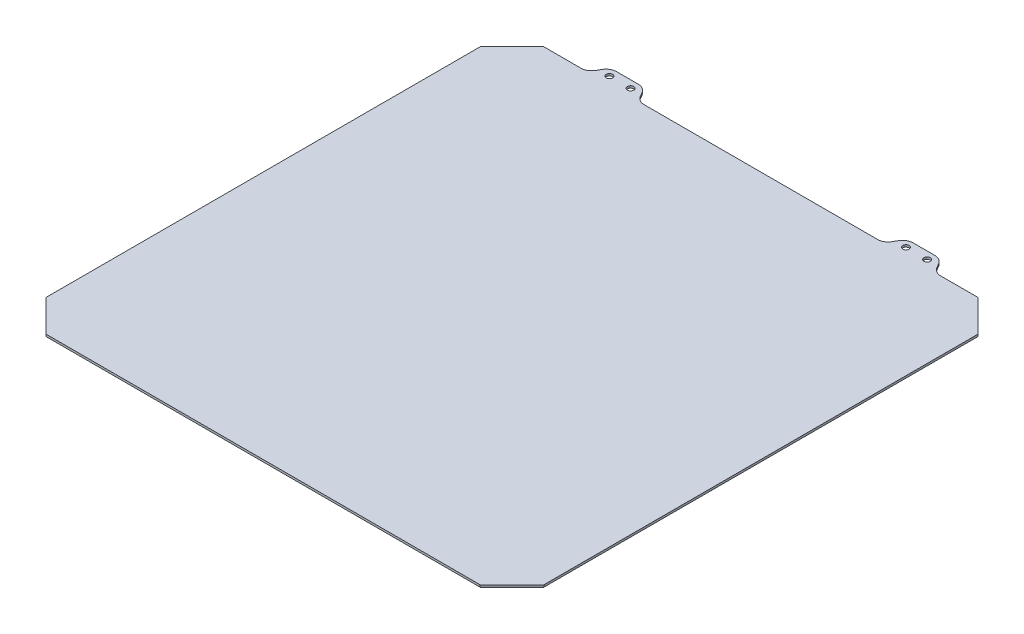
ISO-10303-21;
HEADER;
FILE_DESCRIPTION(('STEP AP214'),'2;1');
FILE_NAME('part.step','',(''),(''),'','','');
FILE_SCHEMA(('AUTOMOTIVE_DESIGN { 1 0 10303 214 1 1 1 1 }'));
ENDSEC;
DATA;
#1=APPLICATION_CONTEXT('core data for automotive mechanical design processes');
#2=APPLICATION_PROTOCOL_DEFINITION('international standard','automotive_design',2000,#1);
#3=PRODUCT_CONTEXT('',#1,'mechanical');
#4=PRODUCT('Part','Part','',(#3));
#5=PRODUCT_RELATED_PRODUCT_CATEGORY('part','',(#4));
#6=PRODUCT_DEFINITION_FORMATION('','',#4);
#7=PRODUCT_DEFINITION_CONTEXT('part definition',#1,'design');
#8=PRODUCT_DEFINITION('design','',#6,#7);
#9=PRODUCT_DEFINITION_SHAPE('','',#8);
#10=(LENGTH_UNIT() NAMED_UNIT(*) SI_UNIT(.MILLI.,.METRE.));
#11=(NAMED_UNIT(*) PLANE_ANGLE_UNIT() SI_UNIT($,.RADIAN.));
#12=(NAMED_UNIT(*) SI_UNIT($,.STERADIAN.) SOLID_ANGLE_UNIT());
#13=UNCERTAINTY_MEASURE_WITH_UNIT(LENGTH_MEASURE(1.E-05),#10,'distance_accuracy_value','');
#14=(GEOMETRIC_REPRESENTATION_CONTEXT(3) GLOBAL_UNCERTAINTY_ASSIGNED_CONTEXT((#13)) GLOBAL_UNIT_ASSIGNED_CONTEXT((#10,
#11,#12)) REPRESENTATION_CONTEXT('',''));
#15=CARTESIAN_POINT('',(0.,0.,0.));
#16=DIRECTION('',(0.,0.,1.));
#17=DIRECTION('',(1.,0.,0.));
#18=AXIS2_PLACEMENT_3D('',#15,#16,#17);
#19=CARTESIAN_POINT('',(117.5,1.,-117.5));
#20=DIRECTION('',(0.,0.,1.));
#21=DIRECTION('',(1.,0.,0.));
#22=AXIS2_PLACEMENT_3D('',#19,#20,#21);
#23=PLANE('',#22);
#24=DIRECTION('',(-1.,0.,0.));
#25=VECTOR('',#24,1.);
#26=CARTESIAN_POINT('',(117.5,0.,-117.5));
#27=LINE('',#26,#25);
#28=CARTESIAN_POINT('',(55.0717967697245,0.,-117.5));
#29=VERTEX_POINT('',#28);
#30=CARTESIAN_POINT('',(-55.0717967697244,0.,-117.5));
#31=VERTEX_POINT('',#30);
#32=EDGE_CURVE('E326',#29,#31,#27,.T.);
#33=ORIENTED_EDGE('',*,*,#32,.T.);
#34=DIRECTION('',(0.,-1.,0.));
#35=VECTOR('',#34,1.);
#36=CARTESIAN_POINT('',(-55.0717967697245,1.,-117.5));
#37=LINE('',#36,#35);
#38=CARTESIAN_POINT('',(-55.0717967697244,1.,-117.5));
#39=VERTEX_POINT('',#38);
#40=EDGE_CURVE('E363',#31,#39,#37,.F.);
#41=ORIENTED_EDGE('',*,*,#40,.T.);
#42=DIRECTION('',(-1.,0.,0.));
#43=VECTOR('',#42,1.);
#44=CARTESIAN_POINT('',(117.5,1.,-117.5));
#45=LINE('',#44,#43);
#46=CARTESIAN_POINT('',(55.0717967697245,1.,-117.5));
#47=VERTEX_POINT('',#46);
#48=EDGE_CURVE('E311',#47,#39,#45,.T.);
#49=ORIENTED_EDGE('',*,*,#48,.F.);
#50=DIRECTION('',(0.,-1.,0.));
#51=VECTOR('',#50,1.);
#52=CARTESIAN_POINT('',(55.0717967697245,0.,-117.5));
#53=LINE('',#52,#51);
#54=EDGE_CURVE('E359',#47,#29,#53,.T.);
#55=ORIENTED_EDGE('',*,*,#54,.T.);
#56=EDGE_LOOP('',(#33,#41,#49,#55));
#57=FACE_BOUND('',#56,.T.);
#58=ADVANCED_FACE('F43',(#57),#23,.F.);
#59=CARTESIAN_POINT('',(102.5,1.,-117.5));
#60=VERTEX_POINT('',#59);
#61=CARTESIAN_POINT('',(84.9282032302756,1.,-117.5));
#62=VERTEX_POINT('',#61);
#63=EDGE_CURVE('E308',#60,#62,#45,.T.);
#64=ORIENTED_EDGE('',*,*,#63,.F.);
#65=DIRECTION('',(0.,-1.,0.));
#66=VECTOR('',#65,1.);
#67=CARTESIAN_POINT('',(102.5,1.,-117.5));
#68=LINE('',#67,#66);
#69=CARTESIAN_POINT('',(102.5,0.,-117.5));
#70=VERTEX_POINT('',#69);
#71=EDGE_CURVE('E419',#60,#70,#68,.T.);
#72=ORIENTED_EDGE('',*,*,#71,.T.);
#73=CARTESIAN_POINT('',(84.9282032302756,0.,-117.5));
#74=VERTEX_POINT('',#73);
#75=EDGE_CURVE('E300',#70,#74,#27,.T.);
#76=ORIENTED_EDGE('',*,*,#75,.T.);
#77=DIRECTION('',(0.,-1.,0.));
#78=VECTOR('',#77,1.);
#79=CARTESIAN_POINT('',(84.9282032302755,1.,-117.5));
#80=LINE('',#79,#78);
#81=EDGE_CURVE('E387',#74,#62,#80,.F.);
#82=ORIENTED_EDGE('',*,*,#81,.T.);
#83=EDGE_LOOP('',(#64,#72,#76,#82));
#84=FACE_BOUND('',#83,.T.);
#85=ADVANCED_FACE('F491',(#84),#23,.F.);
#86=CARTESIAN_POINT('',(-117.5,1.,-117.5));
#87=DIRECTION('',(1.,0.,0.));
#88=DIRECTION('',(0.,0.,-1.));
#89=AXIS2_PLACEMENT_3D('',#86,#87,#88);
#90=PLANE('',#89);
#91=DIRECTION('',(0.,0.,1.));
#92=VECTOR('',#91,1.);
#93=CARTESIAN_POINT('',(-117.5,0.,-117.5));
#94=LINE('',#93,#92);
#95=CARTESIAN_POINT('',(-117.5,0.,-102.5));
#96=VERTEX_POINT('',#95);
#97=CARTESIAN_POINT('',(-117.5,0.,102.5));
#98=VERTEX_POINT('',#97);
#99=EDGE_CURVE('E312',#96,#98,#94,.T.);
#100=ORIENTED_EDGE('',*,*,#99,.T.);
#101=DIRECTION('',(0.,1.,0.));
#102=VECTOR('',#101,1.);
#103=CARTESIAN_POINT('',(-117.5,1.,102.5));
#104=LINE('',#103,#102);
#105=CARTESIAN_POINT('',(-117.5,1.,102.5));
#106=VERTEX_POINT('',#105);
#107=EDGE_CURVE('E53',#98,#106,#104,.T.);
#108=ORIENTED_EDGE('',*,*,#107,.T.);
#109=DIRECTION('',(0.,0.,1.));
#110=VECTOR('',#109,1.);
#111=CARTESIAN_POINT('',(-117.5,1.,-117.5));
#112=LINE('',#111,#110);
#113=CARTESIAN_POINT('',(-117.5,1.,-102.5));
#114=VERTEX_POINT('',#113);
#115=EDGE_CURVE('E296',#114,#106,#112,.T.);
#116=ORIENTED_EDGE('',*,*,#115,.F.);
#117=DIRECTION('',(0.,-1.,0.));
#118=VECTOR('',#117,1.);
#119=CARTESIAN_POINT('',(-117.5,1.,-102.5));
#120=LINE('',#119,#118);
#121=EDGE_CURVE('E457',#114,#96,#120,.T.);
#122=ORIENTED_EDGE('',*,*,#121,.T.);
#123=EDGE_LOOP('',(#100,#108,#116,#122));
#124=FACE_BOUND('',#123,.T.);
#125=ADVANCED_FACE('F464',(#124),#90,.F.);
#126=CARTESIAN_POINT('',(117.5,1.,117.5));
#127=DIRECTION('',(0.,0.,-1.));
#128=DIRECTION('',(-1.,0.,0.));
#129=AXIS2_PLACEMENT_3D('',#126,#127,#128);
#130=PLANE('',#129);
#131=DIRECTION('',(1.,0.,0.));
#132=VECTOR('',#131,1.);
#133=CARTESIAN_POINT('',(117.5,0.,117.5));
#134=LINE('',#133,#132);
#135=CARTESIAN_POINT('',(-102.5,0.,117.5));
#136=VERTEX_POINT('',#135);
#137=CARTESIAN_POINT('',(102.5,0.,117.5));
#138=VERTEX_POINT('',#137);
#139=EDGE_CURVE('E316',#136,#138,#134,.T.);
#140=ORIENTED_EDGE('',*,*,#139,.T.);
#141=DIRECTION('',(0.,1.,0.));
#142=VECTOR('',#141,1.);
#143=CARTESIAN_POINT('',(102.5,1.,117.5));
#144=LINE('',#143,#142);
#145=CARTESIAN_POINT('',(102.5,1.,117.5));
#146=VERTEX_POINT('',#145);
#147=EDGE_CURVE('E63',#138,#146,#144,.T.);
#148=ORIENTED_EDGE('',*,*,#147,.T.);
#149=DIRECTION('',(1.,0.,0.));
#150=VECTOR('',#149,1.);
#151=CARTESIAN_POINT('',(117.5,1.,117.5));
#152=LINE('',#151,#150);
#153=CARTESIAN_POINT('',(-102.5,1.,117.5));
#154=VERTEX_POINT('',#153);
#155=EDGE_CURVE('E299',#154,#146,#152,.T.);
#156=ORIENTED_EDGE('',*,*,#155,.F.);
#157=DIRECTION('',(0.,-1.,0.));
#158=VECTOR('',#157,1.);
#159=CARTESIAN_POINT('',(-102.5,1.,117.5));
#160=LINE('',#159,#158);
#161=EDGE_CURVE('E452',#154,#136,#160,.T.);
#162=ORIENTED_EDGE('',*,*,#161,.T.);
#163=EDGE_LOOP('',(#140,#148,#156,#162));
#164=FACE_BOUND('',#163,.T.);
#165=ADVANCED_FACE('F475',(#164),#130,.F.);
#166=CARTESIAN_POINT('',(117.5,1.,-117.5));
#167=DIRECTION('',(-1.,0.,0.));
#168=DIRECTION('',(0.,0.,1.));
#169=AXIS2_PLACEMENT_3D('',#166,#167,#168);
#170=PLANE('',#169);
#171=DIRECTION('',(0.,0.,-1.));
#172=VECTOR('',#171,1.);
#173=CARTESIAN_POINT('',(117.5,0.,-117.5));
#174=LINE('',#173,#172);
#175=CARTESIAN_POINT('',(117.5,0.,102.5));
#176=VERTEX_POINT('',#175);
#177=CARTESIAN_POINT('',(117.5,0.,-102.5));
#178=VERTEX_POINT('',#177);
#179=EDGE_CURVE('E319',#176,#178,#174,.T.);
#180=ORIENTED_EDGE('',*,*,#179,.T.);
#181=DIRECTION('',(0.,1.,0.));
#182=VECTOR('',#181,1.);
#183=CARTESIAN_POINT('',(117.5,1.,-102.5));
#184=LINE('',#183,#182);
#185=CARTESIAN_POINT('',(117.5,1.,-102.5));
#186=VERTEX_POINT('',#185);
#187=EDGE_CURVE('E439',#178,#186,#184,.T.);
#188=ORIENTED_EDGE('',*,*,#187,.T.);
#189=DIRECTION('',(0.,0.,-1.));
#190=VECTOR('',#189,1.);
#191=CARTESIAN_POINT('',(117.5,1.,-117.5));
#192=LINE('',#191,#190);
#193=CARTESIAN_POINT('',(117.5,1.,102.5));
#194=VERTEX_POINT('',#193);
#195=EDGE_CURVE('E303',#194,#186,#192,.T.);
#196=ORIENTED_EDGE('',*,*,#195,.F.);
#197=DIRECTION('',(0.,-1.,0.));
#198=VECTOR('',#197,1.);
#199=CARTESIAN_POINT('',(117.5,1.,102.5));
#200=LINE('',#199,#198);
#201=EDGE_CURVE('E435',#194,#176,#200,.T.);
#202=ORIENTED_EDGE('',*,*,#201,.T.);
#203=EDGE_LOOP('',(#180,#188,#196,#202));
#204=FACE_BOUND('',#203,.T.);
#205=ADVANCED_FACE('F483',(#204),#170,.F.);
#206=CARTESIAN_POINT('',(-84.9282032302755,0.,-117.5));
#207=VERTEX_POINT('',#206);
#208=CARTESIAN_POINT('',(-102.5,0.,-117.5));
#209=VERTEX_POINT('',#208);
#210=EDGE_CURVE('E323',#207,#209,#27,.T.);
#211=ORIENTED_EDGE('',*,*,#210,.T.);
#212=DIRECTION('',(0.,1.,0.));
#213=VECTOR('',#212,1.);
#214=CARTESIAN_POINT('',(-102.5,1.,-117.5));
#215=LINE('',#214,#213);
#216=CARTESIAN_POINT('',(-102.5,1.,-117.5));
#217=VERTEX_POINT('',#216);
#218=EDGE_CURVE('E11',#209,#217,#215,.T.);
#219=ORIENTED_EDGE('',*,*,#218,.T.);
#220=CARTESIAN_POINT('',(-84.9282032302755,1.,-117.5));
#221=VERTEX_POINT('',#220);
#222=EDGE_CURVE('E307',#221,#217,#45,.T.);
#223=ORIENTED_EDGE('',*,*,#222,.F.);
#224=DIRECTION('',(0.,-1.,0.));
#225=VECTOR('',#224,1.);
#226=CARTESIAN_POINT('',(-84.9282032302756,0.,-117.5));
#227=LINE('',#226,#225);
#228=EDGE_CURVE('E391',#221,#207,#227,.T.);
#229=ORIENTED_EDGE('',*,*,#228,.T.);
#230=EDGE_LOOP('',(#211,#219,#223,#229));
#231=FACE_BOUND('',#230,.T.);
#232=ADVANCED_FACE('F578',(#231),#23,.F.);
#233=CARTESIAN_POINT('',(0.,1.,0.));
#234=DIRECTION('',(0.,-1.,0.));
#235=DIRECTION('',(0.,0.,-1.));
#236=AXIS2_PLACEMENT_3D('',#233,#234,#235);
#237=PLANE('',#236);
#238=ORIENTED_EDGE('',*,*,#195,.T.);
#239=DIRECTION('',(0.707106781186546,0.,0.70710678118655));
#240=VECTOR('',#239,1.);
#241=CARTESIAN_POINT('',(102.5,1.,-117.5));
#242=LINE('',#241,#240);
#243=EDGE_CURVE('E449',#186,#60,#242,.F.);
#244=ORIENTED_EDGE('',*,*,#243,.T.);
#245=ORIENTED_EDGE('',*,*,#63,.T.);
#246=CARTESIAN_POINT('',(84.9282032302755,1.,-122.5));
#247=DIRECTION('',(0.,-1.,0.));
#248=DIRECTION('',(0.,0.,-1.));
#249=AXIS2_PLACEMENT_3D('',#246,#247,#248);
#250=CIRCLE('',#249,5.);
#251=CARTESIAN_POINT('',(80.5980762113534,1.,-120.));
#252=VERTEX_POINT('',#251);
#253=EDGE_CURVE('E411',#62,#252,#250,.T.);
#254=ORIENTED_EDGE('',*,*,#253,.T.);
#255=DIRECTION('',(-0.500000000000005,0.,-0.866025403784436));
#256=VECTOR('',#255,1.);
#257=CARTESIAN_POINT('',(82.0414518843275,1.,-117.5));
#258=LINE('',#257,#256);
#259=CARTESIAN_POINT('',(79.4433756729741,1.,-122.));
#260=VERTEX_POINT('',#259);
#261=EDGE_CURVE('E502',#252,#260,#258,.T.);
#262=ORIENTED_EDGE('',*,*,#261,.T.);
#263=CARTESIAN_POINT('',(75.1132486540519,1.,-119.5));
#264=DIRECTION('',(0.,-1.,0.));
#265=DIRECTION('',(0.,0.,-1.));
#266=AXIS2_PLACEMENT_3D('',#263,#264,#265);
#267=CIRCLE('',#266,5.);
#268=CARTESIAN_POINT('',(75.1132486540519,1.,-124.5));
#269=VERTEX_POINT('',#268);
#270=EDGE_CURVE('E340',#260,#269,#267,.F.);
#271=ORIENTED_EDGE('',*,*,#270,.T.);
#272=DIRECTION('',(-1.,0.,0.));
#273=VECTOR('',#272,1.);
#274=CARTESIAN_POINT('',(78.,1.,-124.5));
#275=LINE('',#274,#273);
#276=CARTESIAN_POINT('',(64.8867513459481,1.,-124.5));
#277=VERTEX_POINT('',#276);
#278=EDGE_CURVE('E508',#269,#277,#275,.T.);
#279=ORIENTED_EDGE('',*,*,#278,.T.);
#280=CARTESIAN_POINT('',(64.8867513459481,1.,-119.5));
#281=DIRECTION('',(0.,-1.,0.));
#282=DIRECTION('',(0.,0.,-1.));
#283=AXIS2_PLACEMENT_3D('',#280,#281,#282);
#284=CIRCLE('',#283,5.);
#285=CARTESIAN_POINT('',(60.556624327026,1.,-122.));
#286=VERTEX_POINT('',#285);
#287=EDGE_CURVE('E343',#277,#286,#284,.F.);
#288=ORIENTED_EDGE('',*,*,#287,.T.);
#289=DIRECTION('',(-0.500000000000006,0.,0.866025403784435));
#290=VECTOR('',#289,1.);
#291=CARTESIAN_POINT('',(62.,1.,-124.5));
#292=LINE('',#291,#290);
#293=CARTESIAN_POINT('',(59.4019237886467,1.,-120.));
#294=VERTEX_POINT('',#293);
#295=EDGE_CURVE('E509',#286,#294,#292,.T.);
#296=ORIENTED_EDGE('',*,*,#295,.T.);
#297=CARTESIAN_POINT('',(55.0717967697245,1.,-122.5));
#298=DIRECTION('',(0.,-1.,0.));
#299=DIRECTION('',(0.,0.,-1.));
#300=AXIS2_PLACEMENT_3D('',#297,#298,#299);
#301=CIRCLE('',#300,5.);
#302=EDGE_CURVE('E404',#294,#47,#301,.T.);
#303=ORIENTED_EDGE('',*,*,#302,.T.);
#304=ORIENTED_EDGE('',*,*,#48,.T.);
#305=CARTESIAN_POINT('',(-55.0717967697245,1.,-122.5));
#306=DIRECTION('',(0.,-1.,0.));
#307=DIRECTION('',(0.,0.,-1.));
#308=AXIS2_PLACEMENT_3D('',#305,#306,#307);
#309=CIRCLE('',#308,5.);
#310=CARTESIAN_POINT('',(-59.4019237886466,1.,-120.));
#311=VERTEX_POINT('',#310);
#312=EDGE_CURVE('E398',#39,#311,#309,.T.);
#313=ORIENTED_EDGE('',*,*,#312,.T.);
#314=DIRECTION('',(-0.500000000000005,0.,-0.866025403784436));
#315=VECTOR('',#314,1.);
#316=CARTESIAN_POINT('',(-62.,1.,-124.5));
#317=LINE('',#316,#315);
#318=CARTESIAN_POINT('',(-60.5566243270259,1.,-122.));
#319=VERTEX_POINT('',#318);
#320=EDGE_CURVE('E283',#311,#319,#317,.T.);
#321=ORIENTED_EDGE('',*,*,#320,.T.);
#322=CARTESIAN_POINT('',(-64.8867513459481,1.,-119.5));
#323=DIRECTION('',(0.,-1.,0.));
#324=DIRECTION('',(0.,0.,-1.));
#325=AXIS2_PLACEMENT_3D('',#322,#323,#324);
#326=CIRCLE('',#325,5.);
#327=CARTESIAN_POINT('',(-64.8867513459481,1.,-124.5));
#328=VERTEX_POINT('',#327);
#329=EDGE_CURVE('E346',#319,#328,#326,.F.);
#330=ORIENTED_EDGE('',*,*,#329,.T.);
#331=DIRECTION('',(-1.,0.,0.));
#332=VECTOR('',#331,1.);
#333=CARTESIAN_POINT('',(-78.,1.,-124.5));
#334=LINE('',#333,#332);
#335=CARTESIAN_POINT('',(-75.1132486540519,1.,-124.5));
#336=VERTEX_POINT('',#335);
#337=EDGE_CURVE('E289',#328,#336,#334,.T.);
#338=ORIENTED_EDGE('',*,*,#337,.T.);
#339=CARTESIAN_POINT('',(-75.1132486540519,1.,-119.5));
#340=DIRECTION('',(0.,-1.,0.));
#341=DIRECTION('',(0.,0.,-1.));
#342=AXIS2_PLACEMENT_3D('',#339,#340,#341);
#343=CIRCLE('',#342,5.);
#344=CARTESIAN_POINT('',(-79.4433756729741,1.,-122.));
#345=VERTEX_POINT('',#344);
#346=EDGE_CURVE('E349',#336,#345,#343,.F.);
#347=ORIENTED_EDGE('',*,*,#346,.T.);
#348=DIRECTION('',(-0.500000000000004,0.,0.866025403784436));
#349=VECTOR('',#348,1.);
#350=CARTESIAN_POINT('',(-82.0414518843274,1.,-117.5));
#351=LINE('',#350,#349);
#352=CARTESIAN_POINT('',(-80.5980762113534,1.,-120.));
#353=VERTEX_POINT('',#352);
#354=EDGE_CURVE('E272',#345,#353,#351,.T.);
#355=ORIENTED_EDGE('',*,*,#354,.T.);
#356=CARTESIAN_POINT('',(-84.9282032302756,1.,-122.5));
#357=DIRECTION('',(0.,-1.,0.));
#358=DIRECTION('',(0.,0.,-1.));
#359=AXIS2_PLACEMENT_3D('',#356,#357,#358);
#360=CIRCLE('',#359,5.);
#361=EDGE_CURVE('E416',#353,#221,#360,.T.);
#362=ORIENTED_EDGE('',*,*,#361,.T.);
#363=ORIENTED_EDGE('',*,*,#222,.T.);
#364=DIRECTION('',(0.707106781186549,0.,-0.707106781186546));
#365=VECTOR('',#364,1.);
#366=CARTESIAN_POINT('',(-117.5,1.,-102.5));
#367=LINE('',#366,#365);
#368=EDGE_CURVE('E441',#217,#114,#367,.F.);
#369=ORIENTED_EDGE('',*,*,#368,.T.);
#370=ORIENTED_EDGE('',*,*,#115,.T.);
#371=DIRECTION('',(-0.707106781186547,0.,-0.707106781186548));
#372=VECTOR('',#371,1.);
#373=CARTESIAN_POINT('',(-102.5,1.,117.5));
#374=LINE('',#373,#372);
#375=EDGE_CURVE('E70',#106,#154,#374,.F.);
#376=ORIENTED_EDGE('',*,*,#375,.T.);
#377=ORIENTED_EDGE('',*,*,#155,.T.);
#378=DIRECTION('',(-0.707106781186548,0.,0.707106781186547));
#379=VECTOR('',#378,1.);
#380=CARTESIAN_POINT('',(117.5,1.,102.5));
#381=LINE('',#380,#379);
#382=EDGE_CURVE('E446',#146,#194,#381,.F.);
#383=ORIENTED_EDGE('',*,*,#382,.T.);
#384=EDGE_LOOP('',(#238,#244,#245,#254,#262,#271,#279,#288,#296,#303,#304,#313,#321,#330,#338,
#347,#355,#362,#363,#369,#370,#376,#377,#383));
#385=FACE_BOUND('',#384,.T.);
#386=CARTESIAN_POINT('',(-75.,1.,-121.));
#387=DIRECTION('',(0.,1.,0.));
#388=DIRECTION('',(0.,0.,1.));
#389=AXIS2_PLACEMENT_3D('',#386,#387,#388);
#390=CIRCLE('',#389,1.5);
#391=CARTESIAN_POINT('',(-75.,1.,-119.5));
#392=VERTEX_POINT('',#391);
#393=EDGE_CURVE('E539',#392,#392,#390,.T.);
#394=ORIENTED_EDGE('',*,*,#393,.F.);
#395=EDGE_LOOP('',(#394));
#396=FACE_BOUND('',#395,.T.);
#397=CARTESIAN_POINT('',(-65.,1.,-121.));
#398=DIRECTION('',(0.,1.,0.));
#399=DIRECTION('',(0.,0.,1.));
#400=AXIS2_PLACEMENT_3D('',#397,#398,#399);
#401=CIRCLE('',#400,1.5);
#402=CARTESIAN_POINT('',(-65.,1.,-119.5));
#403=VERTEX_POINT('',#402);
#404=EDGE_CURVE('E531',#403,#403,#401,.T.);
#405=ORIENTED_EDGE('',*,*,#404,.F.);
#406=EDGE_LOOP('',(#405));
#407=FACE_BOUND('',#406,.T.);
#408=CARTESIAN_POINT('',(65.,1.,-121.));
#409=DIRECTION('',(0.,1.,0.));
#410=DIRECTION('',(0.,0.,-1.));
#411=AXIS2_PLACEMENT_3D('',#408,#409,#410);
#412=CIRCLE('',#411,1.5);
#413=CARTESIAN_POINT('',(65.,1.,-122.5));
#414=VERTEX_POINT('',#413);
#415=EDGE_CURVE('E525',#414,#414,#412,.T.);
#416=ORIENTED_EDGE('',*,*,#415,.F.);
#417=EDGE_LOOP('',(#416));
#418=FACE_BOUND('',#417,.T.);
#419=CARTESIAN_POINT('',(75.0000000000001,1.,-121.));
#420=DIRECTION('',(0.,1.,0.));
#421=DIRECTION('',(0.,0.,-1.));
#422=AXIS2_PLACEMENT_3D('',#419,#420,#421);
#423=CIRCLE('',#422,1.5);
#424=CARTESIAN_POINT('',(75.0000000000001,1.,-122.5));
#425=VERTEX_POINT('',#424);
#426=EDGE_CURVE('E873',#425,#425,#423,.T.);
#427=ORIENTED_EDGE('',*,*,#426,.F.);
#428=EDGE_LOOP('',(#427));
#429=FACE_BOUND('',#428,.T.);
#430=ADVANCED_FACE('F468',(#385,#396,#407,#418,#429),#237,.F.);
#431=CARTESIAN_POINT('',(0.,0.,0.));
#432=DIRECTION('',(0.,-1.,0.));
#433=DIRECTION('',(0.,0.,-1.));
#434=AXIS2_PLACEMENT_3D('',#431,#432,#433);
#435=PLANE('',#434);
#436=ORIENTED_EDGE('',*,*,#75,.F.);
#437=DIRECTION('',(-0.707106781186546,0.,-0.70710678118655));
#438=VECTOR('',#437,1.);
#439=CARTESIAN_POINT('',(110.,0.,-110.));
#440=LINE('',#439,#438);
#441=EDGE_CURVE('E432',#70,#178,#440,.F.);
#442=ORIENTED_EDGE('',*,*,#441,.T.);
#443=ORIENTED_EDGE('',*,*,#179,.F.);
#444=DIRECTION('',(0.707106781186548,0.,-0.707106781186547));
#445=VECTOR('',#444,1.);
#446=CARTESIAN_POINT('',(110.,0.,110.));
#447=LINE('',#446,#445);
#448=EDGE_CURVE('E429',#176,#138,#447,.F.);
#449=ORIENTED_EDGE('',*,*,#448,.T.);
#450=ORIENTED_EDGE('',*,*,#139,.F.);
#451=DIRECTION('',(0.707106781186547,0.,0.707106781186548));
#452=VECTOR('',#451,1.);
#453=CARTESIAN_POINT('',(-110.,0.,110.));
#454=LINE('',#453,#452);
#455=EDGE_CURVE('E426',#136,#98,#454,.F.);
#456=ORIENTED_EDGE('',*,*,#455,.T.);
#457=ORIENTED_EDGE('',*,*,#99,.F.);
#458=DIRECTION('',(-0.707106781186549,0.,0.707106781186546));
#459=VECTOR('',#458,1.);
#460=CARTESIAN_POINT('',(-110.,0.,-110.));
#461=LINE('',#460,#459);
#462=EDGE_CURVE('E423',#96,#209,#461,.F.);
#463=ORIENTED_EDGE('',*,*,#462,.T.);
#464=ORIENTED_EDGE('',*,*,#210,.F.);
#465=CARTESIAN_POINT('',(-84.9282032302756,0.,-122.5));
#466=DIRECTION('',(0.,-1.,0.));
#467=DIRECTION('',(0.,0.,-1.));
#468=AXIS2_PLACEMENT_3D('',#465,#466,#467);
#469=CIRCLE('',#468,5.);
#470=CARTESIAN_POINT('',(-80.5980762113534,0.,-120.));
#471=VERTEX_POINT('',#470);
#472=EDGE_CURVE('E281',#207,#471,#469,.F.);
#473=ORIENTED_EDGE('',*,*,#472,.T.);
#474=DIRECTION('',(-0.500000000000004,0.,0.866025403784436));
#475=VECTOR('',#474,1.);
#476=CARTESIAN_POINT('',(-82.0414518843274,0.,-117.5));
#477=LINE('',#476,#475);
#478=CARTESIAN_POINT('',(-79.4433756729741,0.,-122.));
#479=VERTEX_POINT('',#478);
#480=EDGE_CURVE('E269',#479,#471,#477,.T.);
#481=ORIENTED_EDGE('',*,*,#480,.F.);
#482=CARTESIAN_POINT('',(-75.1132486540519,0.,-119.5));
#483=DIRECTION('',(0.,-1.,0.));
#484=DIRECTION('',(0.,0.,-1.));
#485=AXIS2_PLACEMENT_3D('',#482,#483,#484);
#486=CIRCLE('',#485,5.);
#487=CARTESIAN_POINT('',(-75.1132486540519,0.,-124.5));
#488=VERTEX_POINT('',#487);
#489=EDGE_CURVE('E251',#479,#488,#486,.T.);
#490=ORIENTED_EDGE('',*,*,#489,.T.);
#491=DIRECTION('',(-1.,0.,0.));
#492=VECTOR('',#491,1.);
#493=CARTESIAN_POINT('',(-78.,0.,-124.5));
#494=LINE('',#493,#492);
#495=CARTESIAN_POINT('',(-64.8867513459481,0.,-124.5));
#496=VERTEX_POINT('',#495);
#497=EDGE_CURVE('E284',#496,#488,#494,.T.);
#498=ORIENTED_EDGE('',*,*,#497,.F.);
#499=CARTESIAN_POINT('',(-64.8867513459481,0.,-119.5));
#500=DIRECTION('',(0.,-1.,0.));
#501=DIRECTION('',(0.,0.,-1.));
#502=AXIS2_PLACEMENT_3D('',#499,#500,#501);
#503=CIRCLE('',#502,5.);
#504=CARTESIAN_POINT('',(-60.5566243270259,0.,-122.));
#505=VERTEX_POINT('',#504);
#506=EDGE_CURVE('E263',#496,#505,#503,.T.);
#507=ORIENTED_EDGE('',*,*,#506,.T.);
#508=DIRECTION('',(-0.500000000000005,0.,-0.866025403784436));
#509=VECTOR('',#508,1.);
#510=CARTESIAN_POINT('',(-62.,0.,-124.5));
#511=LINE('',#510,#509);
#512=CARTESIAN_POINT('',(-59.4019237886466,0.,-120.));
#513=VERTEX_POINT('',#512);
#514=EDGE_CURVE('E292',#513,#505,#511,.T.);
#515=ORIENTED_EDGE('',*,*,#514,.F.);
#516=CARTESIAN_POINT('',(-55.0717967697245,0.,-122.5));
#517=DIRECTION('',(0.,-1.,0.));
#518=DIRECTION('',(0.,0.,-1.));
#519=AXIS2_PLACEMENT_3D('',#516,#517,#518);
#520=CIRCLE('',#519,5.);
#521=EDGE_CURVE('E395',#513,#31,#520,.F.);
#522=ORIENTED_EDGE('',*,*,#521,.T.);
#523=ORIENTED_EDGE('',*,*,#32,.F.);
#524=CARTESIAN_POINT('',(55.0717967697245,0.,-122.5));
#525=DIRECTION('',(0.,-1.,0.));
#526=DIRECTION('',(0.,0.,-1.));
#527=AXIS2_PLACEMENT_3D('',#524,#525,#526);
#528=CIRCLE('',#527,5.);
#529=CARTESIAN_POINT('',(59.4019237886467,0.,-120.));
#530=VERTEX_POINT('',#529);
#531=EDGE_CURVE('E401',#29,#530,#528,.F.);
#532=ORIENTED_EDGE('',*,*,#531,.T.);
#533=DIRECTION('',(-0.500000000000006,0.,0.866025403784435));
#534=VECTOR('',#533,1.);
#535=CARTESIAN_POINT('',(62.,0.,-124.5));
#536=LINE('',#535,#534);
#537=CARTESIAN_POINT('',(60.556624327026,0.,-122.));
#538=VERTEX_POINT('',#537);
#539=EDGE_CURVE('E521',#538,#530,#536,.T.);
#540=ORIENTED_EDGE('',*,*,#539,.F.);
#541=CARTESIAN_POINT('',(64.8867513459481,0.,-119.5));
#542=DIRECTION('',(0.,-1.,0.));
#543=DIRECTION('',(0.,0.,-1.));
#544=AXIS2_PLACEMENT_3D('',#541,#542,#543);
#545=CIRCLE('',#544,5.);
#546=CARTESIAN_POINT('',(64.8867513459481,0.,-124.5));
#547=VERTEX_POINT('',#546);
#548=EDGE_CURVE('E330',#538,#547,#545,.T.);
#549=ORIENTED_EDGE('',*,*,#548,.T.);
#550=DIRECTION('',(-1.,0.,0.));
#551=VECTOR('',#550,1.);
#552=CARTESIAN_POINT('',(78.,0.,-124.5));
#553=LINE('',#552,#551);
#554=CARTESIAN_POINT('',(75.1132486540519,0.,-124.5));
#555=VERTEX_POINT('',#554);
#556=EDGE_CURVE('E517',#555,#547,#553,.T.);
#557=ORIENTED_EDGE('',*,*,#556,.F.);
#558=CARTESIAN_POINT('',(75.1132486540519,0.,-119.5));
#559=DIRECTION('',(0.,-1.,0.));
#560=DIRECTION('',(0.,0.,-1.));
#561=AXIS2_PLACEMENT_3D('',#558,#559,#560);
#562=CIRCLE('',#561,5.);
#563=CARTESIAN_POINT('',(79.4433756729741,0.,-122.));
#564=VERTEX_POINT('',#563);
#565=EDGE_CURVE('E274',#555,#564,#562,.T.);
#566=ORIENTED_EDGE('',*,*,#565,.T.);
#567=DIRECTION('',(-0.500000000000005,0.,-0.866025403784436));
#568=VECTOR('',#567,1.);
#569=CARTESIAN_POINT('',(82.0414518843275,0.,-117.5));
#570=LINE('',#569,#568);
#571=CARTESIAN_POINT('',(80.5980762113534,0.,-120.));
#572=VERTEX_POINT('',#571);
#573=EDGE_CURVE('E495',#572,#564,#570,.T.);
#574=ORIENTED_EDGE('',*,*,#573,.F.);
#575=CARTESIAN_POINT('',(84.9282032302755,0.,-122.5));
#576=DIRECTION('',(0.,-1.,0.));
#577=DIRECTION('',(0.,0.,-1.));
#578=AXIS2_PLACEMENT_3D('',#575,#576,#577);
#579=CIRCLE('',#578,5.);
#580=EDGE_CURVE('E407',#572,#74,#579,.F.);
#581=ORIENTED_EDGE('',*,*,#580,.T.);
#582=EDGE_LOOP('',(#436,#442,#443,#449,#450,#456,#457,#463,#464,#473,#481,#490,#498,#507,#515,
#522,#523,#532,#540,#549,#557,#566,#574,#581));
#583=FACE_BOUND('',#582,.T.);
#584=CARTESIAN_POINT('',(-75.,0.,-121.));
#585=DIRECTION('',(0.,1.,0.));
#586=DIRECTION('',(0.,0.,1.));
#587=AXIS2_PLACEMENT_3D('',#584,#585,#586);
#588=CIRCLE('',#587,1.5);
#589=CARTESIAN_POINT('',(-75.,0.,-119.5));
#590=VERTEX_POINT('',#589);
#591=EDGE_CURVE('E535',#590,#590,#588,.T.);
#592=ORIENTED_EDGE('',*,*,#591,.T.);
#593=EDGE_LOOP('',(#592));
#594=FACE_BOUND('',#593,.T.);
#595=CARTESIAN_POINT('',(-65.,0.,-121.));
#596=DIRECTION('',(0.,1.,0.));
#597=DIRECTION('',(0.,0.,1.));
#598=AXIS2_PLACEMENT_3D('',#595,#596,#597);
#599=CIRCLE('',#598,1.5);
#600=CARTESIAN_POINT('',(-65.,0.,-119.5));
#601=VERTEX_POINT('',#600);
#602=EDGE_CURVE('E513',#601,#601,#599,.T.);
#603=ORIENTED_EDGE('',*,*,#602,.T.);
#604=EDGE_LOOP('',(#603));
#605=FACE_BOUND('',#604,.T.);
#606=CARTESIAN_POINT('',(65.,0.,-121.));
#607=DIRECTION('',(0.,1.,0.));
#608=DIRECTION('',(0.,0.,-1.));
#609=AXIS2_PLACEMENT_3D('',#606,#607,#608);
#610=CIRCLE('',#609,1.5);
#611=CARTESIAN_POINT('',(65.,0.,-122.5));
#612=VERTEX_POINT('',#611);
#613=EDGE_CURVE('E867',#612,#612,#610,.T.);
#614=ORIENTED_EDGE('',*,*,#613,.T.);
#615=EDGE_LOOP('',(#614));
#616=FACE_BOUND('',#615,.T.);
#617=CARTESIAN_POINT('',(75.0000000000001,0.,-121.));
#618=DIRECTION('',(0.,1.,0.));
#619=DIRECTION('',(0.,0.,-1.));
#620=AXIS2_PLACEMENT_3D('',#617,#618,#619);
#621=CIRCLE('',#620,1.5);
#622=CARTESIAN_POINT('',(75.0000000000001,0.,-122.5));
#623=VERTEX_POINT('',#622);
#624=EDGE_CURVE('E870',#623,#623,#621,.T.);
#625=ORIENTED_EDGE('',*,*,#624,.T.);
#626=EDGE_LOOP('',(#625));
#627=FACE_BOUND('',#626,.T.);
#628=ADVANCED_FACE('F278',(#583,#594,#605,#616,#627),#435,.T.);
#629=CARTESIAN_POINT('',(-62.,1.,-124.5));
#630=DIRECTION('',(-0.866025403784436,0.,0.500000000000004));
#631=DIRECTION('',(0.500000000000005,0.,0.866025403784436));
#632=AXIS2_PLACEMENT_3D('',#629,#630,#631);
#633=PLANE('',#632);
#634=ORIENTED_EDGE('',*,*,#514,.T.);
#635=DIRECTION('',(0.,-1.,0.));
#636=VECTOR('',#635,1.);
#637=CARTESIAN_POINT('',(-60.5566243270259,1.,-122.));
#638=LINE('',#637,#636);
#639=EDGE_CURVE('E356',#505,#319,#638,.F.);
#640=ORIENTED_EDGE('',*,*,#639,.T.);
#641=ORIENTED_EDGE('',*,*,#320,.F.);
#642=DIRECTION('',(0.,-1.,0.));
#643=VECTOR('',#642,1.);
#644=CARTESIAN_POINT('',(-59.4019237886466,0.,-120.));
#645=LINE('',#644,#643);
#646=EDGE_CURVE('E352',#311,#513,#645,.T.);
#647=ORIENTED_EDGE('',*,*,#646,.T.);
#648=EDGE_LOOP('',(#634,#640,#641,#647));
#649=FACE_BOUND('',#648,.T.);
#650=ADVANCED_FACE('F556',(#649),#633,.F.);
#651=CARTESIAN_POINT('',(-78.,1.,-124.5));
#652=DIRECTION('',(0.,0.,1.));
#653=DIRECTION('',(1.,0.,0.));
#654=AXIS2_PLACEMENT_3D('',#651,#652,#653);
#655=PLANE('',#654);
#656=ORIENTED_EDGE('',*,*,#497,.T.);
#657=DIRECTION('',(0.,-1.,0.));
#658=VECTOR('',#657,1.);
#659=CARTESIAN_POINT('',(-75.1132486540519,1.,-124.5));
#660=LINE('',#659,#658);
#661=EDGE_CURVE('E256',#488,#336,#660,.F.);
#662=ORIENTED_EDGE('',*,*,#661,.T.);
#663=ORIENTED_EDGE('',*,*,#337,.F.);
#664=DIRECTION('',(0.,-1.,0.));
#665=VECTOR('',#664,1.);
#666=CARTESIAN_POINT('',(-64.8867513459481,1.,-124.5));
#667=LINE('',#666,#665);
#668=EDGE_CURVE('E262',#328,#496,#667,.T.);
#669=ORIENTED_EDGE('',*,*,#668,.T.);
#670=EDGE_LOOP('',(#656,#662,#663,#669));
#671=FACE_BOUND('',#670,.T.);
#672=ADVANCED_FACE('F565',(#671),#655,.F.);
#673=CARTESIAN_POINT('',(-82.0414518843274,1.,-117.5));
#674=DIRECTION('',(0.866025403784436,0.,0.500000000000004));
#675=DIRECTION('',(0.500000000000004,0.,-0.866025403784436));
#676=AXIS2_PLACEMENT_3D('',#673,#674,#675);
#677=PLANE('',#676);
#678=ORIENTED_EDGE('',*,*,#354,.F.);
#679=DIRECTION('',(0.,-1.,0.));
#680=VECTOR('',#679,1.);
#681=CARTESIAN_POINT('',(-79.4433756729741,1.,-122.));
#682=LINE('',#681,#680);
#683=EDGE_CURVE('E255',#345,#479,#682,.T.);
#684=ORIENTED_EDGE('',*,*,#683,.T.);
#685=ORIENTED_EDGE('',*,*,#480,.T.);
#686=DIRECTION('',(0.,-1.,0.));
#687=VECTOR('',#686,1.);
#688=CARTESIAN_POINT('',(-80.5980762113534,1.,-120.));
#689=LINE('',#688,#687);
#690=EDGE_CURVE('E275',#471,#353,#689,.F.);
#691=ORIENTED_EDGE('',*,*,#690,.T.);
#692=EDGE_LOOP('',(#678,#684,#685,#691));
#693=FACE_BOUND('',#692,.T.);
#694=ADVANCED_FACE('F268',(#693),#677,.F.);
#695=CARTESIAN_POINT('',(-75.,1.,-121.));
#696=DIRECTION('',(0.,-1.,0.));
#697=DIRECTION('',(0.,0.,-1.));
#698=AXIS2_PLACEMENT_3D('',#695,#696,#697);
#699=CYLINDRICAL_SURFACE('',#698,1.5);
#700=ORIENTED_EDGE('',*,*,#393,.T.);
#701=EDGE_LOOP('',(#700));
#702=FACE_BOUND('',#701,.T.);
#703=ORIENTED_EDGE('',*,*,#591,.F.);
#704=EDGE_LOOP('',(#703));
#705=FACE_BOUND('',#704,.T.);
#706=ADVANCED_FACE('F572',(#702,#705),#699,.F.);
#707=CARTESIAN_POINT('',(-65.,1.,-121.));
#708=DIRECTION('',(0.,-1.,0.));
#709=DIRECTION('',(0.,0.,-1.));
#710=AXIS2_PLACEMENT_3D('',#707,#708,#709);
#711=CYLINDRICAL_SURFACE('',#710,1.5);
#712=ORIENTED_EDGE('',*,*,#404,.T.);
#713=EDGE_LOOP('',(#712));
#714=FACE_BOUND('',#713,.T.);
#715=ORIENTED_EDGE('',*,*,#602,.F.);
#716=EDGE_LOOP('',(#715));
#717=FACE_BOUND('',#716,.T.);
#718=ADVANCED_FACE('F768',(#714,#717),#711,.F.);
#719=CARTESIAN_POINT('',(62.,1.,-124.5));
#720=DIRECTION('',(0.866025403784435,0.,0.500000000000006));
#721=DIRECTION('',(0.500000000000006,0.,-0.866025403784435));
#722=AXIS2_PLACEMENT_3D('',#719,#720,#721);
#723=PLANE('',#722);
#724=ORIENTED_EDGE('',*,*,#539,.T.);
#725=DIRECTION('',(0.,-1.,0.));
#726=VECTOR('',#725,1.);
#727=CARTESIAN_POINT('',(59.4019237886467,1.,-120.));
#728=LINE('',#727,#726);
#729=EDGE_CURVE('E370',#530,#294,#728,.F.);
#730=ORIENTED_EDGE('',*,*,#729,.T.);
#731=ORIENTED_EDGE('',*,*,#295,.F.);
#732=DIRECTION('',(0.,-1.,0.));
#733=VECTOR('',#732,1.);
#734=CARTESIAN_POINT('',(60.556624327026,1.,-122.));
#735=LINE('',#734,#733);
#736=EDGE_CURVE('E366',#286,#538,#735,.T.);
#737=ORIENTED_EDGE('',*,*,#736,.T.);
#738=EDGE_LOOP('',(#724,#730,#731,#737));
#739=FACE_BOUND('',#738,.T.);
#740=ADVANCED_FACE('F761',(#739),#723,.F.);
#741=CARTESIAN_POINT('',(82.0414518843275,1.,-117.5));
#742=DIRECTION('',(-0.866025403784436,0.,0.500000000000004));
#743=DIRECTION('',(0.500000000000005,0.,0.866025403784436));
#744=AXIS2_PLACEMENT_3D('',#741,#742,#743);
#745=PLANE('',#744);
#746=ORIENTED_EDGE('',*,*,#573,.T.);
#747=DIRECTION('',(0.,-1.,0.));
#748=VECTOR('',#747,1.);
#749=CARTESIAN_POINT('',(79.4433756729741,1.,-122.));
#750=LINE('',#749,#748);
#751=EDGE_CURVE('E384',#564,#260,#750,.F.);
#752=ORIENTED_EDGE('',*,*,#751,.T.);
#753=ORIENTED_EDGE('',*,*,#261,.F.);
#754=DIRECTION('',(0.,-1.,0.));
#755=VECTOR('',#754,1.);
#756=CARTESIAN_POINT('',(80.5980762113534,0.,-120.));
#757=LINE('',#756,#755);
#758=EDGE_CURVE('E380',#252,#572,#757,.T.);
#759=ORIENTED_EDGE('',*,*,#758,.T.);
#760=EDGE_LOOP('',(#746,#752,#753,#759));
#761=FACE_BOUND('',#760,.T.);
#762=ADVANCED_FACE('F505',(#761),#745,.F.);
#763=CARTESIAN_POINT('',(78.,1.,-124.5));
#764=DIRECTION('',(0.,0.,1.));
#765=DIRECTION('',(1.,0.,0.));
#766=AXIS2_PLACEMENT_3D('',#763,#764,#765);
#767=PLANE('',#766);
#768=ORIENTED_EDGE('',*,*,#556,.T.);
#769=DIRECTION('',(0.,-1.,0.));
#770=VECTOR('',#769,1.);
#771=CARTESIAN_POINT('',(64.8867513459481,1.,-124.5));
#772=LINE('',#771,#770);
#773=EDGE_CURVE('E377',#547,#277,#772,.F.);
#774=ORIENTED_EDGE('',*,*,#773,.T.);
#775=ORIENTED_EDGE('',*,*,#278,.F.);
#776=DIRECTION('',(0.,-1.,0.));
#777=VECTOR('',#776,1.);
#778=CARTESIAN_POINT('',(75.1132486540519,1.,-124.5));
#779=LINE('',#778,#777);
#780=EDGE_CURVE('E373',#269,#555,#779,.T.);
#781=ORIENTED_EDGE('',*,*,#780,.T.);
#782=EDGE_LOOP('',(#768,#774,#775,#781));
#783=FACE_BOUND('',#782,.T.);
#784=ADVANCED_FACE('F746',(#783),#767,.F.);
#785=CARTESIAN_POINT('',(65.,1.,-121.));
#786=DIRECTION('',(0.,-1.,0.));
#787=DIRECTION('',(0.,0.,-1.));
#788=AXIS2_PLACEMENT_3D('',#785,#786,#787);
#789=CYLINDRICAL_SURFACE('',#788,1.5);
#790=ORIENTED_EDGE('',*,*,#415,.T.);
#791=EDGE_LOOP('',(#790));
#792=FACE_BOUND('',#791,.T.);
#793=ORIENTED_EDGE('',*,*,#613,.F.);
#794=EDGE_LOOP('',(#793));
#795=FACE_BOUND('',#794,.T.);
#796=ADVANCED_FACE('F738',(#792,#795),#789,.F.);
#797=CARTESIAN_POINT('',(75.0000000000001,1.,-121.));
#798=DIRECTION('',(0.,-1.,0.));
#799=DIRECTION('',(0.,0.,-1.));
#800=AXIS2_PLACEMENT_3D('',#797,#798,#799);
#801=CYLINDRICAL_SURFACE('',#800,1.5);
#802=ORIENTED_EDGE('',*,*,#426,.T.);
#803=EDGE_LOOP('',(#802));
#804=FACE_BOUND('',#803,.T.);
#805=ORIENTED_EDGE('',*,*,#624,.F.);
#806=EDGE_LOOP('',(#805));
#807=FACE_BOUND('',#806,.T.);
#808=ADVANCED_FACE('F644',(#804,#807),#801,.F.);
#809=CARTESIAN_POINT('',(-75.1132486540519,1.,-119.5));
#810=DIRECTION('',(0.,-1.,0.));
#811=DIRECTION('',(0.,0.,-1.));
#812=AXIS2_PLACEMENT_3D('',#809,#810,#811);
#813=CYLINDRICAL_SURFACE('',#812,5.);
#814=ORIENTED_EDGE('',*,*,#346,.F.);
#815=ORIENTED_EDGE('',*,*,#661,.F.);
#816=ORIENTED_EDGE('',*,*,#489,.F.);
#817=ORIENTED_EDGE('',*,*,#683,.F.);
#818=EDGE_LOOP('',(#814,#815,#816,#817));
#819=FACE_BOUND('',#818,.T.);
#820=ADVANCED_FACE('F254',(#819),#813,.T.);
#821=CARTESIAN_POINT('',(-64.8867513459481,1.,-119.5));
#822=DIRECTION('',(0.,-1.,0.));
#823=DIRECTION('',(0.,0.,-1.));
#824=AXIS2_PLACEMENT_3D('',#821,#822,#823);
#825=CYLINDRICAL_SURFACE('',#824,5.);
#826=ORIENTED_EDGE('',*,*,#329,.F.);
#827=ORIENTED_EDGE('',*,*,#639,.F.);
#828=ORIENTED_EDGE('',*,*,#506,.F.);
#829=ORIENTED_EDGE('',*,*,#668,.F.);
#830=EDGE_LOOP('',(#826,#827,#828,#829));
#831=FACE_BOUND('',#830,.T.);
#832=ADVANCED_FACE('F561',(#831),#825,.T.);
#833=CARTESIAN_POINT('',(-55.0717967697245,1.,-122.5));
#834=DIRECTION('',(0.,1.,0.));
#835=DIRECTION('',(0.,0.,1.));
#836=AXIS2_PLACEMENT_3D('',#833,#834,#835);
#837=CYLINDRICAL_SURFACE('',#836,5.);
#838=ORIENTED_EDGE('',*,*,#312,.F.);
#839=ORIENTED_EDGE('',*,*,#40,.F.);
#840=ORIENTED_EDGE('',*,*,#521,.F.);
#841=ORIENTED_EDGE('',*,*,#646,.F.);
#842=EDGE_LOOP('',(#838,#839,#840,#841));
#843=FACE_BOUND('',#842,.T.);
#844=ADVANCED_FACE('F635',(#843),#837,.F.);
#845=CARTESIAN_POINT('',(55.0717967697245,1.,-122.5));
#846=DIRECTION('',(0.,1.,0.));
#847=DIRECTION('',(0.,0.,1.));
#848=AXIS2_PLACEMENT_3D('',#845,#846,#847);
#849=CYLINDRICAL_SURFACE('',#848,5.);
#850=ORIENTED_EDGE('',*,*,#302,.F.);
#851=ORIENTED_EDGE('',*,*,#729,.F.);
#852=ORIENTED_EDGE('',*,*,#531,.F.);
#853=ORIENTED_EDGE('',*,*,#54,.F.);
#854=EDGE_LOOP('',(#850,#851,#852,#853));
#855=FACE_BOUND('',#854,.T.);
#856=ADVANCED_FACE('F631',(#855),#849,.F.);
#857=CARTESIAN_POINT('',(64.8867513459481,1.,-119.5));
#858=DIRECTION('',(0.,-1.,0.));
#859=DIRECTION('',(0.,0.,-1.));
#860=AXIS2_PLACEMENT_3D('',#857,#858,#859);
#861=CYLINDRICAL_SURFACE('',#860,5.);
#862=ORIENTED_EDGE('',*,*,#287,.F.);
#863=ORIENTED_EDGE('',*,*,#773,.F.);
#864=ORIENTED_EDGE('',*,*,#548,.F.);
#865=ORIENTED_EDGE('',*,*,#736,.F.);
#866=EDGE_LOOP('',(#862,#863,#864,#865));
#867=FACE_BOUND('',#866,.T.);
#868=ADVANCED_FACE('F627',(#867),#861,.T.);
#869=CARTESIAN_POINT('',(75.1132486540519,1.,-119.5));
#870=DIRECTION('',(0.,-1.,0.));
#871=DIRECTION('',(0.,0.,-1.));
#872=AXIS2_PLACEMENT_3D('',#869,#870,#871);
#873=CYLINDRICAL_SURFACE('',#872,5.);
#874=ORIENTED_EDGE('',*,*,#270,.F.);
#875=ORIENTED_EDGE('',*,*,#751,.F.);
#876=ORIENTED_EDGE('',*,*,#565,.F.);
#877=ORIENTED_EDGE('',*,*,#780,.F.);
#878=EDGE_LOOP('',(#874,#875,#876,#877));
#879=FACE_BOUND('',#878,.T.);
#880=ADVANCED_FACE('F624',(#879),#873,.T.);
#881=CARTESIAN_POINT('',(84.9282032302755,1.,-122.5));
#882=DIRECTION('',(0.,1.,0.));
#883=DIRECTION('',(0.,0.,1.));
#884=AXIS2_PLACEMENT_3D('',#881,#882,#883);
#885=CYLINDRICAL_SURFACE('',#884,5.);
#886=ORIENTED_EDGE('',*,*,#253,.F.);
#887=ORIENTED_EDGE('',*,*,#81,.F.);
#888=ORIENTED_EDGE('',*,*,#580,.F.);
#889=ORIENTED_EDGE('',*,*,#758,.F.);
#890=EDGE_LOOP('',(#886,#887,#888,#889));
#891=FACE_BOUND('',#890,.T.);
#892=ADVANCED_FACE('F499',(#891),#885,.F.);
#893=CARTESIAN_POINT('',(-84.9282032302756,1.,-122.5));
#894=DIRECTION('',(0.,1.,0.));
#895=DIRECTION('',(0.,0.,1.));
#896=AXIS2_PLACEMENT_3D('',#893,#894,#895);
#897=CYLINDRICAL_SURFACE('',#896,5.);
#898=ORIENTED_EDGE('',*,*,#361,.F.);
#899=ORIENTED_EDGE('',*,*,#690,.F.);
#900=ORIENTED_EDGE('',*,*,#472,.F.);
#901=ORIENTED_EDGE('',*,*,#228,.F.);
#902=EDGE_LOOP('',(#898,#899,#900,#901));
#903=FACE_BOUND('',#902,.T.);
#904=ADVANCED_FACE('F618',(#903),#897,.F.);
#905=CARTESIAN_POINT('',(102.5,1.,-117.5));
#906=DIRECTION('',(-0.707106781186549,0.,0.707106781186545));
#907=DIRECTION('',(0.,-1.,0.));
#908=AXIS2_PLACEMENT_3D('',#905,#906,#907);
#909=PLANE('',#908);
#910=ORIENTED_EDGE('',*,*,#243,.F.);
#911=ORIENTED_EDGE('',*,*,#187,.F.);
#912=ORIENTED_EDGE('',*,*,#441,.F.);
#913=ORIENTED_EDGE('',*,*,#71,.F.);
#914=EDGE_LOOP('',(#910,#911,#912,#913));
#915=FACE_BOUND('',#914,.T.);
#916=ADVANCED_FACE('F489',(#915),#909,.F.);
#917=CARTESIAN_POINT('',(117.5,1.,102.5));
#918=DIRECTION('',(-0.707106781186547,0.,-0.707106781186548));
#919=DIRECTION('',(0.,-1.,0.));
#920=AXIS2_PLACEMENT_3D('',#917,#918,#919);
#921=PLANE('',#920);
#922=ORIENTED_EDGE('',*,*,#382,.F.);
#923=ORIENTED_EDGE('',*,*,#147,.F.);
#924=ORIENTED_EDGE('',*,*,#448,.F.);
#925=ORIENTED_EDGE('',*,*,#201,.F.);
#926=EDGE_LOOP('',(#922,#923,#924,#925));
#927=FACE_BOUND('',#926,.T.);
#928=ADVANCED_FACE('F480',(#927),#921,.F.);
#929=CARTESIAN_POINT('',(-102.5,1.,117.5));
#930=DIRECTION('',(0.707106781186548,0.,-0.707106781186547));
#931=DIRECTION('',(0.,-1.,0.));
#932=AXIS2_PLACEMENT_3D('',#929,#930,#931);
#933=PLANE('',#932);
#934=ORIENTED_EDGE('',*,*,#375,.F.);
#935=ORIENTED_EDGE('',*,*,#107,.F.);
#936=ORIENTED_EDGE('',*,*,#455,.F.);
#937=ORIENTED_EDGE('',*,*,#161,.F.);
#938=EDGE_LOOP('',(#934,#935,#936,#937));
#939=FACE_BOUND('',#938,.T.);
#940=ADVANCED_FACE('F473',(#939),#933,.F.);
#941=CARTESIAN_POINT('',(-117.5,1.,-102.5));
#942=DIRECTION('',(0.707106781186546,0.,0.707106781186549));
#943=DIRECTION('',(0.,-1.,0.));
#944=AXIS2_PLACEMENT_3D('',#941,#942,#943);
#945=PLANE('',#944);
#946=ORIENTED_EDGE('',*,*,#368,.F.);
#947=ORIENTED_EDGE('',*,*,#218,.F.);
#948=ORIENTED_EDGE('',*,*,#462,.F.);
#949=ORIENTED_EDGE('',*,*,#121,.F.);
#950=EDGE_LOOP('',(#946,#947,#948,#949));
#951=FACE_BOUND('',#950,.T.);
#952=ADVANCED_FACE('F46',(#951),#945,.F.);
#953=CLOSED_SHELL('',(#58,#85,#125,#165,#205,#232,#430,#628,#650,#672,#694,#706,#718,#740,#762,
#784,#796,#808,#820,#832,#844,#856,#868,#880,#892,#904,#916,#928,#940,#952));
#954=MANIFOLD_SOLID_BREP('B2',#953);
#955=ADVANCED_BREP_SHAPE_REPRESENTATION('',(#18,#954),#14);
#956=SHAPE_DEFINITION_REPRESENTATION(#9,#955);
ENDSEC;
END-ISO-10303-21;
